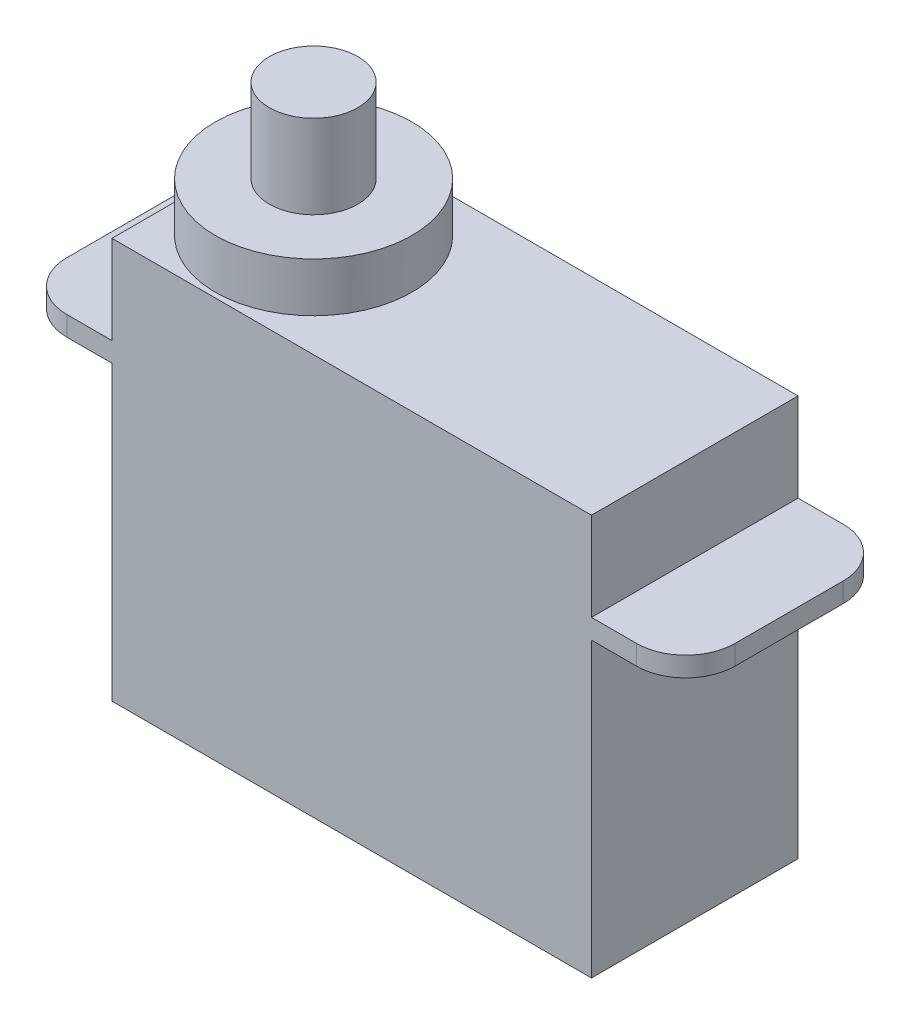
ISO-10303-21;
HEADER;
FILE_DESCRIPTION(('STEP AP214'),'2;1');
FILE_NAME('part.step','',(''),(''),'','','');
FILE_SCHEMA(('AUTOMOTIVE_DESIGN { 1 0 10303 214 1 1 1 1 }'));
ENDSEC;
DATA;
#1=APPLICATION_CONTEXT('core data for automotive mechanical design processes');
#2=APPLICATION_PROTOCOL_DEFINITION('international standard','automotive_design',2000,#1);
#3=PRODUCT_CONTEXT('',#1,'mechanical');
#4=PRODUCT('Part','Part','',(#3));
#5=PRODUCT_RELATED_PRODUCT_CATEGORY('part','',(#4));
#6=PRODUCT_DEFINITION_FORMATION('','',#4);
#7=PRODUCT_DEFINITION_CONTEXT('part definition',#1,'design');
#8=PRODUCT_DEFINITION('design','',#6,#7);
#9=PRODUCT_DEFINITION_SHAPE('','',#8);
#10=(LENGTH_UNIT() NAMED_UNIT(*) SI_UNIT(.MILLI.,.METRE.));
#11=(NAMED_UNIT(*) PLANE_ANGLE_UNIT() SI_UNIT($,.RADIAN.));
#12=(NAMED_UNIT(*) SI_UNIT($,.STERADIAN.) SOLID_ANGLE_UNIT());
#13=UNCERTAINTY_MEASURE_WITH_UNIT(LENGTH_MEASURE(1.E-05),#10,'distance_accuracy_value','');
#14=(GEOMETRIC_REPRESENTATION_CONTEXT(3) GLOBAL_UNCERTAINTY_ASSIGNED_CONTEXT((#13)) GLOBAL_UNIT_ASSIGNED_CONTEXT((#10,
#11,#12)) REPRESENTATION_CONTEXT('',''));
#15=CARTESIAN_POINT('',(0.,0.,0.));
#16=DIRECTION('',(0.,0.,1.));
#17=DIRECTION('',(1.,0.,0.));
#18=AXIS2_PLACEMENT_3D('',#15,#16,#17);
#19=CARTESIAN_POINT('',(0.,16.3,0.));
#20=DIRECTION('',(1.,0.,0.));
#21=DIRECTION('',(0.,0.,-1.));
#22=AXIS2_PLACEMENT_3D('',#19,#20,#21);
#23=PLANE('',#22);
#24=DIRECTION('',(0.,-1.,0.));
#25=VECTOR('',#24,1.);
#26=CARTESIAN_POINT('',(0.,16.3,-8.4));
#27=LINE('',#26,#25);
#28=CARTESIAN_POINT('',(0.,16.3,-8.4));
#29=VERTEX_POINT('',#28);
#30=CARTESIAN_POINT('',(0.,12.7,-8.4));
#31=VERTEX_POINT('',#30);
#32=EDGE_CURVE('E176',#29,#31,#27,.T.);
#33=ORIENTED_EDGE('',*,*,#32,.T.);
#34=DIRECTION('',(0.,0.,1.));
#35=VECTOR('',#34,1.);
#36=CARTESIAN_POINT('',(0.,12.7,0.));
#37=LINE('',#36,#35);
#38=CARTESIAN_POINT('',(0.,12.7,0.));
#39=VERTEX_POINT('',#38);
#40=EDGE_CURVE('E183',#31,#39,#37,.T.);
#41=ORIENTED_EDGE('',*,*,#40,.T.);
#42=DIRECTION('',(0.,-1.,0.));
#43=VECTOR('',#42,1.);
#44=CARTESIAN_POINT('',(0.,16.3,0.));
#45=LINE('',#44,#43);
#46=CARTESIAN_POINT('',(0.,16.3,0.));
#47=VERTEX_POINT('',#46);
#48=EDGE_CURVE('E248',#47,#39,#45,.T.);
#49=ORIENTED_EDGE('',*,*,#48,.F.);
#50=DIRECTION('',(0.,0.,1.));
#51=VECTOR('',#50,1.);
#52=CARTESIAN_POINT('',(0.,16.3,0.));
#53=LINE('',#52,#51);
#54=CARTESIAN_POINT('',(0.,16.3,-4.2));
#55=VERTEX_POINT('',#54);
#56=EDGE_CURVE('E226',#55,#47,#53,.T.);
#57=ORIENTED_EDGE('',*,*,#56,.F.);
#58=EDGE_CURVE('E223',#29,#55,#53,.T.);
#59=ORIENTED_EDGE('',*,*,#58,.F.);
#60=EDGE_LOOP('',(#33,#41,#49,#57,#59));
#61=FACE_BOUND('',#60,.T.);
#62=ADVANCED_FACE('F35',(#61),#23,.F.);
#63=CARTESIAN_POINT('',(19.5,16.3,0.));
#64=DIRECTION('',(-1.,0.,0.));
#65=DIRECTION('',(0.,0.,1.));
#66=AXIS2_PLACEMENT_3D('',#63,#64,#65);
#67=PLANE('',#66);
#68=DIRECTION('',(0.,0.,1.));
#69=VECTOR('',#68,1.);
#70=CARTESIAN_POINT('',(19.5,12.7,0.));
#71=LINE('',#70,#69);
#72=CARTESIAN_POINT('',(19.5,12.7,-8.4));
#73=VERTEX_POINT('',#72);
#74=CARTESIAN_POINT('',(19.5,12.7,0.));
#75=VERTEX_POINT('',#74);
#76=EDGE_CURVE('E201',#73,#75,#71,.T.);
#77=ORIENTED_EDGE('',*,*,#76,.F.);
#78=DIRECTION('',(0.,-1.,0.));
#79=VECTOR('',#78,1.);
#80=CARTESIAN_POINT('',(19.5,16.3,-8.4));
#81=LINE('',#80,#79);
#82=CARTESIAN_POINT('',(19.5,16.3,-8.4));
#83=VERTEX_POINT('',#82);
#84=EDGE_CURVE('E241',#83,#73,#81,.T.);
#85=ORIENTED_EDGE('',*,*,#84,.F.);
#86=DIRECTION('',(0.,0.,-1.));
#87=VECTOR('',#86,1.);
#88=CARTESIAN_POINT('',(19.5,16.3,0.));
#89=LINE('',#88,#87);
#90=CARTESIAN_POINT('',(19.5,16.3,0.));
#91=VERTEX_POINT('',#90);
#92=EDGE_CURVE('E228',#91,#83,#89,.T.);
#93=ORIENTED_EDGE('',*,*,#92,.F.);
#94=DIRECTION('',(0.,-1.,0.));
#95=VECTOR('',#94,1.);
#96=CARTESIAN_POINT('',(19.5,16.3,0.));
#97=LINE('',#96,#95);
#98=EDGE_CURVE('E245',#91,#75,#97,.T.);
#99=ORIENTED_EDGE('',*,*,#98,.T.);
#100=EDGE_LOOP('',(#77,#85,#93,#99));
#101=FACE_BOUND('',#100,.T.);
#102=ADVANCED_FACE('F305',(#101),#67,.F.);
#103=DIRECTION('',(0.,0.,-1.));
#104=VECTOR('',#103,1.);
#105=CARTESIAN_POINT('',(19.5,11.9,0.));
#106=LINE('',#105,#104);
#107=CARTESIAN_POINT('',(19.5,11.9,0.));
#108=VERTEX_POINT('',#107);
#109=CARTESIAN_POINT('',(19.5,11.9,-8.4));
#110=VERTEX_POINT('',#109);
#111=EDGE_CURVE('E196',#108,#110,#106,.T.);
#112=ORIENTED_EDGE('',*,*,#111,.F.);
#113=CARTESIAN_POINT('',(19.5,0.,0.));
#114=VERTEX_POINT('',#113);
#115=EDGE_CURVE('E244',#108,#114,#97,.T.);
#116=ORIENTED_EDGE('',*,*,#115,.T.);
#117=DIRECTION('',(0.,0.,-1.));
#118=VECTOR('',#117,1.);
#119=CARTESIAN_POINT('',(19.5,0.,0.));
#120=LINE('',#119,#118);
#121=CARTESIAN_POINT('',(19.5,0.,-8.4));
#122=VERTEX_POINT('',#121);
#123=EDGE_CURVE('E235',#114,#122,#120,.T.);
#124=ORIENTED_EDGE('',*,*,#123,.T.);
#125=EDGE_CURVE('E240',#110,#122,#81,.T.);
#126=ORIENTED_EDGE('',*,*,#125,.F.);
#127=EDGE_LOOP('',(#112,#116,#124,#126));
#128=FACE_BOUND('',#127,.T.);
#129=ADVANCED_FACE('F326',(#128),#67,.F.);
#130=CARTESIAN_POINT('',(0.,11.9,0.));
#131=VERTEX_POINT('',#130);
#132=CARTESIAN_POINT('',(0.,0.,0.));
#133=VERTEX_POINT('',#132);
#134=EDGE_CURVE('E181',#131,#133,#45,.T.);
#135=ORIENTED_EDGE('',*,*,#134,.F.);
#136=DIRECTION('',(0.,0.,-1.));
#137=VECTOR('',#136,1.);
#138=CARTESIAN_POINT('',(0.,11.9,0.));
#139=LINE('',#138,#137);
#140=CARTESIAN_POINT('',(0.,11.9,-8.4));
#141=VERTEX_POINT('',#140);
#142=EDGE_CURVE('E160',#131,#141,#139,.T.);
#143=ORIENTED_EDGE('',*,*,#142,.T.);
#144=CARTESIAN_POINT('',(0.,0.,-8.4));
#145=VERTEX_POINT('',#144);
#146=EDGE_CURVE('E169',#141,#145,#27,.T.);
#147=ORIENTED_EDGE('',*,*,#146,.T.);
#148=DIRECTION('',(0.,0.,1.));
#149=VECTOR('',#148,1.);
#150=CARTESIAN_POINT('',(0.,0.,0.));
#151=LINE('',#150,#149);
#152=EDGE_CURVE('E220',#145,#133,#151,.T.);
#153=ORIENTED_EDGE('',*,*,#152,.T.);
#154=EDGE_LOOP('',(#135,#143,#147,#153));
#155=FACE_BOUND('',#154,.T.);
#156=ADVANCED_FACE('F180',(#155),#23,.F.);
#157=CARTESIAN_POINT('',(0.,16.3,0.));
#158=DIRECTION('',(0.,0.,-1.));
#159=DIRECTION('',(-1.,0.,0.));
#160=AXIS2_PLACEMENT_3D('',#157,#158,#159);
#161=PLANE('',#160);
#162=DIRECTION('',(1.,0.,0.));
#163=VECTOR('',#162,1.);
#164=CARTESIAN_POINT('',(-3.835,12.7,0.));
#165=LINE('',#164,#163);
#166=CARTESIAN_POINT('',(-1.835,12.7,0.));
#167=VERTEX_POINT('',#166);
#168=EDGE_CURVE('E194',#167,#39,#165,.T.);
#169=ORIENTED_EDGE('',*,*,#168,.F.);
#170=DIRECTION('',(0.,-1.,0.));
#171=VECTOR('',#170,1.);
#172=CARTESIAN_POINT('',(-1.835,11.9,0.));
#173=LINE('',#172,#171);
#174=CARTESIAN_POINT('',(-1.835,11.9,0.));
#175=VERTEX_POINT('',#174);
#176=EDGE_CURVE('E269',#167,#175,#173,.T.);
#177=ORIENTED_EDGE('',*,*,#176,.T.);
#178=DIRECTION('',(1.,0.,0.));
#179=VECTOR('',#178,1.);
#180=CARTESIAN_POINT('',(-3.835,11.9,0.));
#181=LINE('',#180,#179);
#182=EDGE_CURVE('E166',#175,#131,#181,.T.);
#183=ORIENTED_EDGE('',*,*,#182,.T.);
#184=ORIENTED_EDGE('',*,*,#134,.T.);
#185=DIRECTION('',(1.,0.,0.));
#186=VECTOR('',#185,1.);
#187=CARTESIAN_POINT('',(0.,0.,0.));
#188=LINE('',#187,#186);
#189=EDGE_CURVE('E232',#133,#114,#188,.T.);
#190=ORIENTED_EDGE('',*,*,#189,.T.);
#191=ORIENTED_EDGE('',*,*,#115,.F.);
#192=DIRECTION('',(-1.,0.,0.));
#193=VECTOR('',#192,1.);
#194=CARTESIAN_POINT('',(23.335,11.9,0.));
#195=LINE('',#194,#193);
#196=CARTESIAN_POINT('',(21.335,11.9,0.));
#197=VERTEX_POINT('',#196);
#198=EDGE_CURVE('E214',#197,#108,#195,.T.);
#199=ORIENTED_EDGE('',*,*,#198,.F.);
#200=DIRECTION('',(0.,-1.,0.));
#201=VECTOR('',#200,1.);
#202=CARTESIAN_POINT('',(21.335,12.7,0.));
#203=LINE('',#202,#201);
#204=CARTESIAN_POINT('',(21.335,12.7,0.));
#205=VERTEX_POINT('',#204);
#206=EDGE_CURVE('E267',#197,#205,#203,.F.);
#207=ORIENTED_EDGE('',*,*,#206,.T.);
#208=DIRECTION('',(-1.,0.,0.));
#209=VECTOR('',#208,1.);
#210=CARTESIAN_POINT('',(23.335,12.7,0.));
#211=LINE('',#210,#209);
#212=EDGE_CURVE('E204',#205,#75,#211,.T.);
#213=ORIENTED_EDGE('',*,*,#212,.T.);
#214=ORIENTED_EDGE('',*,*,#98,.F.);
#215=DIRECTION('',(1.,0.,0.));
#216=VECTOR('',#215,1.);
#217=CARTESIAN_POINT('',(0.,16.3,0.));
#218=LINE('',#217,#216);
#219=EDGE_CURVE('E225',#47,#91,#218,.T.);
#220=ORIENTED_EDGE('',*,*,#219,.F.);
#221=ORIENTED_EDGE('',*,*,#48,.T.);
#222=EDGE_LOOP('',(#169,#177,#183,#184,#190,#191,#199,#207,#213,#214,#220,#221));
#223=FACE_BOUND('',#222,.T.);
#224=ADVANCED_FACE('F292',(#223),#161,.F.);
#225=CARTESIAN_POINT('',(0.,16.3,-8.4));
#226=DIRECTION('',(0.,0.,1.));
#227=DIRECTION('',(1.,0.,0.));
#228=AXIS2_PLACEMENT_3D('',#225,#226,#227);
#229=PLANE('',#228);
#230=DIRECTION('',(1.,0.,0.));
#231=VECTOR('',#230,1.);
#232=CARTESIAN_POINT('',(-3.835,11.9,-8.4));
#233=LINE('',#232,#231);
#234=CARTESIAN_POINT('',(-1.835,11.9,-8.4));
#235=VERTEX_POINT('',#234);
#236=EDGE_CURVE('E155',#235,#141,#233,.T.);
#237=ORIENTED_EDGE('',*,*,#236,.F.);
#238=DIRECTION('',(0.,1.,0.));
#239=VECTOR('',#238,1.);
#240=CARTESIAN_POINT('',(-1.835,12.7,-8.4));
#241=LINE('',#240,#239);
#242=CARTESIAN_POINT('',(-1.835,12.7,-8.4));
#243=VERTEX_POINT('',#242);
#244=EDGE_CURVE('E39',#235,#243,#241,.T.);
#245=ORIENTED_EDGE('',*,*,#244,.T.);
#246=DIRECTION('',(1.,0.,0.));
#247=VECTOR('',#246,1.);
#248=CARTESIAN_POINT('',(-3.835,12.7,-8.4));
#249=LINE('',#248,#247);
#250=EDGE_CURVE('E165',#243,#31,#249,.T.);
#251=ORIENTED_EDGE('',*,*,#250,.T.);
#252=ORIENTED_EDGE('',*,*,#32,.F.);
#253=DIRECTION('',(-1.,0.,0.));
#254=VECTOR('',#253,1.);
#255=CARTESIAN_POINT('',(0.,16.3,-8.4));
#256=LINE('',#255,#254);
#257=EDGE_CURVE('E177',#83,#29,#256,.T.);
#258=ORIENTED_EDGE('',*,*,#257,.F.);
#259=ORIENTED_EDGE('',*,*,#84,.T.);
#260=DIRECTION('',(-1.,0.,0.));
#261=VECTOR('',#260,1.);
#262=CARTESIAN_POINT('',(23.335,12.7,-8.4));
#263=LINE('',#262,#261);
#264=CARTESIAN_POINT('',(21.335,12.7,-8.4));
#265=VERTEX_POINT('',#264);
#266=EDGE_CURVE('E210',#265,#73,#263,.T.);
#267=ORIENTED_EDGE('',*,*,#266,.F.);
#268=DIRECTION('',(0.,1.,0.));
#269=VECTOR('',#268,1.);
#270=CARTESIAN_POINT('',(21.335,11.9,-8.4));
#271=LINE('',#270,#269);
#272=CARTESIAN_POINT('',(21.335,11.9,-8.4));
#273=VERTEX_POINT('',#272);
#274=EDGE_CURVE('E261',#265,#273,#271,.F.);
#275=ORIENTED_EDGE('',*,*,#274,.T.);
#276=DIRECTION('',(-1.,0.,0.));
#277=VECTOR('',#276,1.);
#278=CARTESIAN_POINT('',(23.335,11.9,-8.4));
#279=LINE('',#278,#277);
#280=EDGE_CURVE('E212',#273,#110,#279,.T.);
#281=ORIENTED_EDGE('',*,*,#280,.T.);
#282=ORIENTED_EDGE('',*,*,#125,.T.);
#283=DIRECTION('',(-1.,0.,0.));
#284=VECTOR('',#283,1.);
#285=CARTESIAN_POINT('',(0.,0.,-8.4));
#286=LINE('',#285,#284);
#287=EDGE_CURVE('E172',#122,#145,#286,.T.);
#288=ORIENTED_EDGE('',*,*,#287,.T.);
#289=ORIENTED_EDGE('',*,*,#146,.F.);
#290=EDGE_LOOP('',(#237,#245,#251,#252,#258,#259,#267,#275,#281,#282,#288,#289));
#291=FACE_BOUND('',#290,.T.);
#292=ADVANCED_FACE('F170',(#291),#229,.F.);
#293=CARTESIAN_POINT('',(0.,16.3,0.));
#294=DIRECTION('',(0.,-1.,0.));
#295=DIRECTION('',(0.,0.,-1.));
#296=AXIS2_PLACEMENT_3D('',#293,#294,#295);
#297=PLANE('',#296);
#298=ORIENTED_EDGE('',*,*,#58,.T.);
#299=CARTESIAN_POINT('',(4.,16.3,-4.2));
#300=DIRECTION('',(0.,1.,0.));
#301=DIRECTION('',(0.,0.,1.));
#302=AXIS2_PLACEMENT_3D('',#299,#300,#301);
#303=CIRCLE('',#302,4.);
#304=EDGE_CURVE('E216',#55,#55,#303,.T.);
#305=ORIENTED_EDGE('',*,*,#304,.F.);
#306=ORIENTED_EDGE('',*,*,#56,.T.);
#307=ORIENTED_EDGE('',*,*,#219,.T.);
#308=ORIENTED_EDGE('',*,*,#92,.T.);
#309=ORIENTED_EDGE('',*,*,#257,.T.);
#310=EDGE_LOOP('',(#298,#305,#306,#307,#308,#309));
#311=FACE_BOUND('',#310,.T.);
#312=ADVANCED_FACE('F297',(#311),#297,.F.);
#313=CARTESIAN_POINT('',(0.,0.,0.));
#314=DIRECTION('',(0.,-1.,0.));
#315=DIRECTION('',(0.,0.,-1.));
#316=AXIS2_PLACEMENT_3D('',#313,#314,#315);
#317=PLANE('',#316);
#318=ORIENTED_EDGE('',*,*,#152,.F.);
#319=ORIENTED_EDGE('',*,*,#287,.F.);
#320=ORIENTED_EDGE('',*,*,#123,.F.);
#321=ORIENTED_EDGE('',*,*,#189,.F.);
#322=EDGE_LOOP('',(#318,#319,#320,#321));
#323=FACE_BOUND('',#322,.T.);
#324=ADVANCED_FACE('F331',(#323),#317,.T.);
#325=CARTESIAN_POINT('',(4.,18.3,-4.2));
#326=DIRECTION('',(0.,-1.,0.));
#327=DIRECTION('',(0.,0.,-1.));
#328=AXIS2_PLACEMENT_3D('',#325,#326,#327);
#329=CYLINDRICAL_SURFACE('',#328,4.);
#330=CARTESIAN_POINT('',(4.,18.3,-4.2));
#331=DIRECTION('',(0.,1.,0.));
#332=DIRECTION('',(0.,0.,1.));
#333=AXIS2_PLACEMENT_3D('',#330,#331,#332);
#334=CIRCLE('',#333,4.);
#335=CARTESIAN_POINT('',(4.,18.3,-0.2));
#336=VERTEX_POINT('',#335);
#337=EDGE_CURVE('E217',#336,#336,#334,.T.);
#338=ORIENTED_EDGE('',*,*,#337,.F.);
#339=EDGE_LOOP('',(#338));
#340=FACE_BOUND('',#339,.T.);
#341=ORIENTED_EDGE('',*,*,#304,.T.);
#342=EDGE_LOOP('',(#341));
#343=FACE_BOUND('',#342,.T.);
#344=ADVANCED_FACE('F363',(#340,#343),#329,.T.);
#345=CARTESIAN_POINT('',(4.,18.3,-4.2));
#346=DIRECTION('',(0.,1.,0.));
#347=DIRECTION('',(0.,0.,1.));
#348=AXIS2_PLACEMENT_3D('',#345,#346,#347);
#349=PLANE('',#348);
#350=CARTESIAN_POINT('',(4.,18.3,-4.2));
#351=DIRECTION('',(0.,1.,0.));
#352=DIRECTION('',(0.,0.,1.));
#353=AXIS2_PLACEMENT_3D('',#350,#351,#352);
#354=CIRCLE('',#353,1.8);
#355=CARTESIAN_POINT('',(4.,18.3,-2.4));
#356=VERTEX_POINT('',#355);
#357=EDGE_CURVE('E11',#356,#356,#354,.T.);
#358=ORIENTED_EDGE('',*,*,#357,.F.);
#359=EDGE_LOOP('',(#358));
#360=FACE_BOUND('',#359,.T.);
#361=ORIENTED_EDGE('',*,*,#337,.T.);
#362=EDGE_LOOP('',(#361));
#363=FACE_BOUND('',#362,.T.);
#364=ADVANCED_FACE('F368',(#360,#363),#349,.T.);
#365=CARTESIAN_POINT('',(23.335,11.9,0.));
#366=DIRECTION('',(0.,1.,0.));
#367=DIRECTION('',(0.,0.,1.));
#368=AXIS2_PLACEMENT_3D('',#365,#366,#367);
#369=PLANE('',#368);
#370=ORIENTED_EDGE('',*,*,#280,.F.);
#371=CARTESIAN_POINT('',(21.335,11.9,-6.4));
#372=DIRECTION('',(0.,1.,0.));
#373=DIRECTION('',(0.,0.,1.));
#374=AXIS2_PLACEMENT_3D('',#371,#372,#373);
#375=CIRCLE('',#374,2.);
#376=CARTESIAN_POINT('',(23.335,11.9,-6.4));
#377=VERTEX_POINT('',#376);
#378=EDGE_CURVE('E265',#273,#377,#375,.F.);
#379=ORIENTED_EDGE('',*,*,#378,.T.);
#380=DIRECTION('',(0.,0.,-1.));
#381=VECTOR('',#380,1.);
#382=CARTESIAN_POINT('',(23.335,11.9,0.));
#383=LINE('',#382,#381);
#384=CARTESIAN_POINT('',(23.335,11.9,-2.));
#385=VERTEX_POINT('',#384);
#386=EDGE_CURVE('E197',#385,#377,#383,.T.);
#387=ORIENTED_EDGE('',*,*,#386,.F.);
#388=CARTESIAN_POINT('',(21.335,11.9,-2.));
#389=DIRECTION('',(0.,1.,0.));
#390=DIRECTION('',(0.,0.,1.));
#391=AXIS2_PLACEMENT_3D('',#388,#389,#390);
#392=CIRCLE('',#391,2.);
#393=EDGE_CURVE('E263',#385,#197,#392,.F.);
#394=ORIENTED_EDGE('',*,*,#393,.T.);
#395=ORIENTED_EDGE('',*,*,#198,.T.);
#396=ORIENTED_EDGE('',*,*,#111,.T.);
#397=EDGE_LOOP('',(#370,#379,#387,#394,#395,#396));
#398=FACE_BOUND('',#397,.T.);
#399=ADVANCED_FACE('F321',(#398),#369,.F.);
#400=CARTESIAN_POINT('',(23.335,12.7,0.));
#401=DIRECTION('',(0.,-1.,0.));
#402=DIRECTION('',(0.,0.,-1.));
#403=AXIS2_PLACEMENT_3D('',#400,#401,#402);
#404=PLANE('',#403);
#405=DIRECTION('',(0.,0.,1.));
#406=VECTOR('',#405,1.);
#407=CARTESIAN_POINT('',(23.335,12.7,0.));
#408=LINE('',#407,#406);
#409=CARTESIAN_POINT('',(23.335,12.7,-6.4));
#410=VERTEX_POINT('',#409);
#411=CARTESIAN_POINT('',(23.335,12.7,-2.));
#412=VERTEX_POINT('',#411);
#413=EDGE_CURVE('E200',#410,#412,#408,.T.);
#414=ORIENTED_EDGE('',*,*,#413,.F.);
#415=CARTESIAN_POINT('',(21.335,12.7,-6.4));
#416=DIRECTION('',(0.,-1.,0.));
#417=DIRECTION('',(0.,0.,-1.));
#418=AXIS2_PLACEMENT_3D('',#415,#416,#417);
#419=CIRCLE('',#418,2.);
#420=EDGE_CURVE('E259',#410,#265,#419,.F.);
#421=ORIENTED_EDGE('',*,*,#420,.T.);
#422=ORIENTED_EDGE('',*,*,#266,.T.);
#423=ORIENTED_EDGE('',*,*,#76,.T.);
#424=ORIENTED_EDGE('',*,*,#212,.F.);
#425=CARTESIAN_POINT('',(21.335,12.7,-2.));
#426=DIRECTION('',(0.,-1.,0.));
#427=DIRECTION('',(0.,0.,-1.));
#428=AXIS2_PLACEMENT_3D('',#425,#426,#427);
#429=CIRCLE('',#428,2.);
#430=EDGE_CURVE('E257',#205,#412,#429,.F.);
#431=ORIENTED_EDGE('',*,*,#430,.T.);
#432=EDGE_LOOP('',(#414,#421,#422,#423,#424,#431));
#433=FACE_BOUND('',#432,.T.);
#434=ADVANCED_FACE('F309',(#433),#404,.F.);
#435=CARTESIAN_POINT('',(23.335,0.,0.));
#436=DIRECTION('',(1.,0.,0.));
#437=DIRECTION('',(0.,0.,-1.));
#438=AXIS2_PLACEMENT_3D('',#435,#436,#437);
#439=PLANE('',#438);
#440=ORIENTED_EDGE('',*,*,#386,.T.);
#441=DIRECTION('',(0.,1.,0.));
#442=VECTOR('',#441,1.);
#443=CARTESIAN_POINT('',(23.335,12.7,-6.4));
#444=LINE('',#443,#442);
#445=EDGE_CURVE('E254',#377,#410,#444,.T.);
#446=ORIENTED_EDGE('',*,*,#445,.T.);
#447=ORIENTED_EDGE('',*,*,#413,.T.);
#448=DIRECTION('',(0.,-1.,0.));
#449=VECTOR('',#448,1.);
#450=CARTESIAN_POINT('',(23.335,11.9,-2.));
#451=LINE('',#450,#449);
#452=EDGE_CURVE('E251',#412,#385,#451,.T.);
#453=ORIENTED_EDGE('',*,*,#452,.T.);
#454=EDGE_LOOP('',(#440,#446,#447,#453));
#455=FACE_BOUND('',#454,.T.);
#456=ADVANCED_FACE('F316',(#455),#439,.T.);
#457=CARTESIAN_POINT('',(21.335,0.,-6.4));
#458=DIRECTION('',(0.,-1.,0.));
#459=DIRECTION('',(0.,0.,-1.));
#460=AXIS2_PLACEMENT_3D('',#457,#458,#459);
#461=CYLINDRICAL_SURFACE('',#460,2.);
#462=ORIENTED_EDGE('',*,*,#378,.F.);
#463=ORIENTED_EDGE('',*,*,#274,.F.);
#464=ORIENTED_EDGE('',*,*,#420,.F.);
#465=ORIENTED_EDGE('',*,*,#445,.F.);
#466=EDGE_LOOP('',(#462,#463,#464,#465));
#467=FACE_BOUND('',#466,.T.);
#468=ADVANCED_FACE('F314',(#467),#461,.T.);
#469=CARTESIAN_POINT('',(21.335,0.,-2.));
#470=DIRECTION('',(0.,1.,0.));
#471=DIRECTION('',(0.,0.,1.));
#472=AXIS2_PLACEMENT_3D('',#469,#470,#471);
#473=CYLINDRICAL_SURFACE('',#472,2.);
#474=ORIENTED_EDGE('',*,*,#430,.F.);
#475=ORIENTED_EDGE('',*,*,#206,.F.);
#476=ORIENTED_EDGE('',*,*,#393,.F.);
#477=ORIENTED_EDGE('',*,*,#452,.F.);
#478=EDGE_LOOP('',(#474,#475,#476,#477));
#479=FACE_BOUND('',#478,.T.);
#480=ADVANCED_FACE('F381',(#479),#473,.T.);
#481=CARTESIAN_POINT('',(-3.835,12.7,0.));
#482=DIRECTION('',(0.,1.,0.));
#483=DIRECTION('',(0.,0.,1.));
#484=AXIS2_PLACEMENT_3D('',#481,#482,#483);
#485=PLANE('',#484);
#486=DIRECTION('',(0.,0.,1.));
#487=VECTOR('',#486,1.);
#488=CARTESIAN_POINT('',(-3.835,12.7,0.));
#489=LINE('',#488,#487);
#490=CARTESIAN_POINT('',(-3.835,12.7,-6.4));
#491=VERTEX_POINT('',#490);
#492=CARTESIAN_POINT('',(-3.835,12.7,-2.));
#493=VERTEX_POINT('',#492);
#494=EDGE_CURVE('E182',#491,#493,#489,.T.);
#495=ORIENTED_EDGE('',*,*,#494,.T.);
#496=CARTESIAN_POINT('',(-1.835,12.7,-2.));
#497=DIRECTION('',(0.,1.,0.));
#498=DIRECTION('',(0.,0.,1.));
#499=AXIS2_PLACEMENT_3D('',#496,#497,#498);
#500=CIRCLE('',#499,2.);
#501=EDGE_CURVE('E278',#493,#167,#500,.T.);
#502=ORIENTED_EDGE('',*,*,#501,.T.);
#503=ORIENTED_EDGE('',*,*,#168,.T.);
#504=ORIENTED_EDGE('',*,*,#40,.F.);
#505=ORIENTED_EDGE('',*,*,#250,.F.);
#506=CARTESIAN_POINT('',(-1.835,12.7,-6.4));
#507=DIRECTION('',(0.,1.,0.));
#508=DIRECTION('',(0.,0.,1.));
#509=AXIS2_PLACEMENT_3D('',#506,#507,#508);
#510=CIRCLE('',#509,2.);
#511=EDGE_CURVE('E51',#243,#491,#510,.T.);
#512=ORIENTED_EDGE('',*,*,#511,.T.);
#513=EDGE_LOOP('',(#495,#502,#503,#504,#505,#512));
#514=FACE_BOUND('',#513,.T.);
#515=ADVANCED_FACE('F285',(#514),#485,.T.);
#516=CARTESIAN_POINT('',(-3.835,11.9,0.));
#517=DIRECTION('',(0.,-1.,0.));
#518=DIRECTION('',(0.,0.,-1.));
#519=AXIS2_PLACEMENT_3D('',#516,#517,#518);
#520=PLANE('',#519);
#521=ORIENTED_EDGE('',*,*,#182,.F.);
#522=CARTESIAN_POINT('',(-1.835,11.9,-2.));
#523=DIRECTION('',(0.,-1.,0.));
#524=DIRECTION('',(0.,0.,-1.));
#525=AXIS2_PLACEMENT_3D('',#522,#523,#524);
#526=CIRCLE('',#525,2.);
#527=CARTESIAN_POINT('',(-3.835,11.9,-2.));
#528=VERTEX_POINT('',#527);
#529=EDGE_CURVE('E273',#175,#528,#526,.T.);
#530=ORIENTED_EDGE('',*,*,#529,.T.);
#531=DIRECTION('',(0.,0.,-1.));
#532=VECTOR('',#531,1.);
#533=CARTESIAN_POINT('',(-3.835,11.9,0.));
#534=LINE('',#533,#532);
#535=CARTESIAN_POINT('',(-3.835,11.9,-6.4));
#536=VERTEX_POINT('',#535);
#537=EDGE_CURVE('E185',#528,#536,#534,.T.);
#538=ORIENTED_EDGE('',*,*,#537,.T.);
#539=CARTESIAN_POINT('',(-1.835,11.9,-6.4));
#540=DIRECTION('',(0.,-1.,0.));
#541=DIRECTION('',(0.,0.,-1.));
#542=AXIS2_PLACEMENT_3D('',#539,#540,#541);
#543=CIRCLE('',#542,2.);
#544=EDGE_CURVE('E163',#536,#235,#543,.T.);
#545=ORIENTED_EDGE('',*,*,#544,.T.);
#546=ORIENTED_EDGE('',*,*,#236,.T.);
#547=ORIENTED_EDGE('',*,*,#142,.F.);
#548=EDGE_LOOP('',(#521,#530,#538,#545,#546,#547));
#549=FACE_BOUND('',#548,.T.);
#550=ADVANCED_FACE('F158',(#549),#520,.T.);
#551=CARTESIAN_POINT('',(-3.835,0.,0.));
#552=DIRECTION('',(-1.,0.,0.));
#553=DIRECTION('',(0.,0.,-1.));
#554=AXIS2_PLACEMENT_3D('',#551,#552,#553);
#555=PLANE('',#554);
#556=ORIENTED_EDGE('',*,*,#537,.F.);
#557=DIRECTION('',(0.,-1.,0.));
#558=VECTOR('',#557,1.);
#559=CARTESIAN_POINT('',(-3.835,12.7,-2.));
#560=LINE('',#559,#558);
#561=EDGE_CURVE('E59',#528,#493,#560,.F.);
#562=ORIENTED_EDGE('',*,*,#561,.T.);
#563=ORIENTED_EDGE('',*,*,#494,.F.);
#564=DIRECTION('',(0.,1.,0.));
#565=VECTOR('',#564,1.);
#566=CARTESIAN_POINT('',(-3.835,11.9,-6.4));
#567=LINE('',#566,#565);
#568=EDGE_CURVE('E275',#491,#536,#567,.F.);
#569=ORIENTED_EDGE('',*,*,#568,.T.);
#570=EDGE_LOOP('',(#556,#562,#563,#569));
#571=FACE_BOUND('',#570,.T.);
#572=ADVANCED_FACE('F333',(#571),#555,.T.);
#573=CARTESIAN_POINT('',(-1.835,16.3,-2.));
#574=DIRECTION('',(0.,1.,0.));
#575=DIRECTION('',(0.,0.,1.));
#576=AXIS2_PLACEMENT_3D('',#573,#574,#575);
#577=CYLINDRICAL_SURFACE('',#576,2.);
#578=ORIENTED_EDGE('',*,*,#501,.F.);
#579=ORIENTED_EDGE('',*,*,#561,.F.);
#580=ORIENTED_EDGE('',*,*,#529,.F.);
#581=ORIENTED_EDGE('',*,*,#176,.F.);
#582=EDGE_LOOP('',(#578,#579,#580,#581));
#583=FACE_BOUND('',#582,.T.);
#584=ADVANCED_FACE('F334',(#583),#577,.T.);
#585=CARTESIAN_POINT('',(-1.835,16.3,-6.4));
#586=DIRECTION('',(0.,-1.,0.));
#587=DIRECTION('',(0.,0.,-1.));
#588=AXIS2_PLACEMENT_3D('',#585,#586,#587);
#589=CYLINDRICAL_SURFACE('',#588,2.);
#590=ORIENTED_EDGE('',*,*,#544,.F.);
#591=ORIENTED_EDGE('',*,*,#568,.F.);
#592=ORIENTED_EDGE('',*,*,#511,.F.);
#593=ORIENTED_EDGE('',*,*,#244,.F.);
#594=EDGE_LOOP('',(#590,#591,#592,#593));
#595=FACE_BOUND('',#594,.T.);
#596=ADVANCED_FACE('F37',(#595),#589,.T.);
#597=CARTESIAN_POINT('',(4.,21.7,-4.2));
#598=DIRECTION('',(0.,-1.,0.));
#599=DIRECTION('',(0.,0.,-1.));
#600=AXIS2_PLACEMENT_3D('',#597,#598,#599);
#601=CYLINDRICAL_SURFACE('',#600,1.8);
#602=CARTESIAN_POINT('',(4.,21.7,-4.2));
#603=DIRECTION('',(0.,1.,0.));
#604=DIRECTION('',(0.,0.,1.));
#605=AXIS2_PLACEMENT_3D('',#602,#603,#604);
#606=CIRCLE('',#605,1.8);
#607=CARTESIAN_POINT('',(4.,21.7,-2.4));
#608=VERTEX_POINT('',#607);
#609=EDGE_CURVE('E188',#608,#608,#606,.T.);
#610=ORIENTED_EDGE('',*,*,#609,.F.);
#611=EDGE_LOOP('',(#610));
#612=FACE_BOUND('',#611,.T.);
#613=ORIENTED_EDGE('',*,*,#357,.T.);
#614=EDGE_LOOP('',(#613));
#615=FACE_BOUND('',#614,.T.);
#616=ADVANCED_FACE('F340',(#612,#615),#601,.T.);
#617=CARTESIAN_POINT('',(4.,21.7,-4.2));
#618=DIRECTION('',(0.,1.,0.));
#619=DIRECTION('',(0.,0.,1.));
#620=AXIS2_PLACEMENT_3D('',#617,#618,#619);
#621=PLANE('',#620);
#622=ORIENTED_EDGE('',*,*,#609,.T.);
#623=EDGE_LOOP('',(#622));
#624=FACE_BOUND('',#623,.T.);
#625=ADVANCED_FACE('F386',(#624),#621,.T.);
#626=CLOSED_SHELL('',(#62,#102,#129,#156,#224,#292,#312,#324,#344,#364,#399,#434,#456,#468,#480,
#515,#550,#572,#584,#596,#616,#625));
#627=MANIFOLD_SOLID_BREP('B2',#626);
#628=ADVANCED_BREP_SHAPE_REPRESENTATION('',(#18,#627),#14);
#629=SHAPE_DEFINITION_REPRESENTATION(#9,#628);
ENDSEC;
END-ISO-10303-21;
